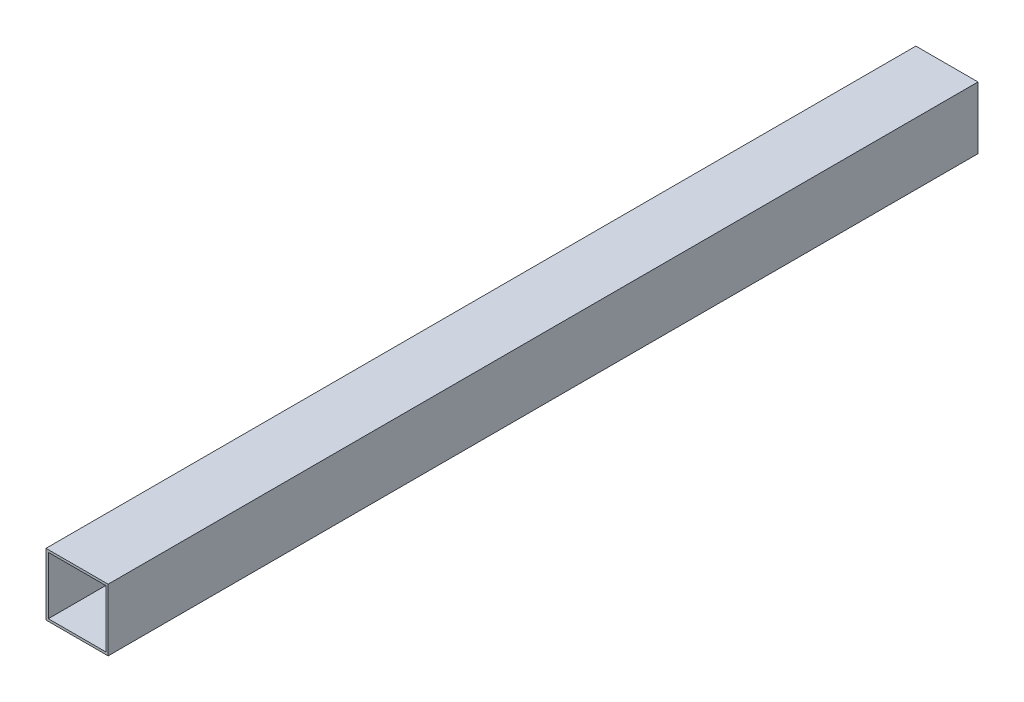
ISO-10303-21;
HEADER;
FILE_DESCRIPTION(('STEP AP214'),'2;1');
FILE_NAME('part.step','',(''),(''),'','','');
FILE_SCHEMA(('AUTOMOTIVE_DESIGN { 1 0 10303 214 1 1 1 1 }'));
ENDSEC;
DATA;
#1=APPLICATION_CONTEXT('core data for automotive mechanical design processes');
#2=APPLICATION_PROTOCOL_DEFINITION('international standard','automotive_design',2000,#1);
#3=PRODUCT_CONTEXT('',#1,'mechanical');
#4=PRODUCT('Part','Part','',(#3));
#5=PRODUCT_RELATED_PRODUCT_CATEGORY('part','',(#4));
#6=PRODUCT_DEFINITION_FORMATION('','',#4);
#7=PRODUCT_DEFINITION_CONTEXT('part definition',#1,'design');
#8=PRODUCT_DEFINITION('design','',#6,#7);
#9=PRODUCT_DEFINITION_SHAPE('','',#8);
#10=(LENGTH_UNIT() NAMED_UNIT(*) SI_UNIT(.MILLI.,.METRE.));
#11=(NAMED_UNIT(*) PLANE_ANGLE_UNIT() SI_UNIT($,.RADIAN.));
#12=(NAMED_UNIT(*) SI_UNIT($,.STERADIAN.) SOLID_ANGLE_UNIT());
#13=UNCERTAINTY_MEASURE_WITH_UNIT(LENGTH_MEASURE(1.E-05),#10,'distance_accuracy_value','');
#14=(GEOMETRIC_REPRESENTATION_CONTEXT(3) GLOBAL_UNCERTAINTY_ASSIGNED_CONTEXT((#13)) GLOBAL_UNIT_ASSIGNED_CONTEXT((#10,
#11,#12)) REPRESENTATION_CONTEXT('',''));
#15=CARTESIAN_POINT('',(0.,0.,0.));
#16=DIRECTION('',(0.,0.,1.));
#17=DIRECTION('',(1.,0.,0.));
#18=AXIS2_PLACEMENT_3D('',#15,#16,#17);
#19=CARTESIAN_POINT('',(0.,0.,560.));
#20=DIRECTION('',(0.,0.,-1.));
#21=DIRECTION('',(-1.,0.,0.));
#22=AXIS2_PLACEMENT_3D('',#19,#20,#21);
#23=PLANE('',#22);
#24=DIRECTION('',(0.,1.,0.));
#25=VECTOR('',#24,1.);
#26=CARTESIAN_POINT('',(20.,-20.,560.));
#27=LINE('',#26,#25);
#28=CARTESIAN_POINT('',(20.,-20.,560.));
#29=VERTEX_POINT('',#28);
#30=CARTESIAN_POINT('',(20.,20.,560.));
#31=VERTEX_POINT('',#30);
#32=EDGE_CURVE('E134',#29,#31,#27,.T.);
#33=ORIENTED_EDGE('',*,*,#32,.T.);
#34=DIRECTION('',(-1.,0.,0.));
#35=VECTOR('',#34,1.);
#36=CARTESIAN_POINT('',(-20.,20.,560.));
#37=LINE('',#36,#35);
#38=CARTESIAN_POINT('',(-20.,20.,560.));
#39=VERTEX_POINT('',#38);
#40=EDGE_CURVE('E137',#31,#39,#37,.T.);
#41=ORIENTED_EDGE('',*,*,#40,.T.);
#42=DIRECTION('',(0.,-1.,0.));
#43=VECTOR('',#42,1.);
#44=CARTESIAN_POINT('',(-20.,-20.,560.));
#45=LINE('',#44,#43);
#46=CARTESIAN_POINT('',(-20.,-20.,560.));
#47=VERTEX_POINT('',#46);
#48=EDGE_CURVE('E140',#39,#47,#45,.T.);
#49=ORIENTED_EDGE('',*,*,#48,.T.);
#50=DIRECTION('',(1.,0.,0.));
#51=VECTOR('',#50,1.);
#52=CARTESIAN_POINT('',(-20.,-20.,560.));
#53=LINE('',#52,#51);
#54=EDGE_CURVE('E142',#47,#29,#53,.T.);
#55=ORIENTED_EDGE('',*,*,#54,.T.);
#56=EDGE_LOOP('',(#33,#41,#49,#55));
#57=FACE_BOUND('',#56,.T.);
#58=DIRECTION('',(0.,1.,0.));
#59=VECTOR('',#58,1.);
#60=CARTESIAN_POINT('',(18.5,-18.5,560.));
#61=LINE('',#60,#59);
#62=CARTESIAN_POINT('',(18.5,-18.5,560.));
#63=VERTEX_POINT('',#62);
#64=CARTESIAN_POINT('',(18.5,18.5,560.));
#65=VERTEX_POINT('',#64);
#66=EDGE_CURVE('E98',#63,#65,#61,.T.);
#67=ORIENTED_EDGE('',*,*,#66,.F.);
#68=DIRECTION('',(1.,0.,0.));
#69=VECTOR('',#68,1.);
#70=CARTESIAN_POINT('',(-18.5,-18.5,560.));
#71=LINE('',#70,#69);
#72=CARTESIAN_POINT('',(-18.5,-18.5,560.));
#73=VERTEX_POINT('',#72);
#74=EDGE_CURVE('E120',#73,#63,#71,.T.);
#75=ORIENTED_EDGE('',*,*,#74,.F.);
#76=DIRECTION('',(0.,-1.,0.));
#77=VECTOR('',#76,1.);
#78=CARTESIAN_POINT('',(-18.5,-18.5,560.));
#79=LINE('',#78,#77);
#80=CARTESIAN_POINT('',(-18.5,18.5,560.));
#81=VERTEX_POINT('',#80);
#82=EDGE_CURVE('E118',#81,#73,#79,.T.);
#83=ORIENTED_EDGE('',*,*,#82,.F.);
#84=DIRECTION('',(-1.,0.,0.));
#85=VECTOR('',#84,1.);
#86=CARTESIAN_POINT('',(-18.5,18.5,560.));
#87=LINE('',#86,#85);
#88=EDGE_CURVE('E106',#65,#81,#87,.T.);
#89=ORIENTED_EDGE('',*,*,#88,.F.);
#90=EDGE_LOOP('',(#67,#75,#83,#89));
#91=FACE_BOUND('',#90,.T.);
#92=ADVANCED_FACE('F33',(#57,#91),#23,.F.);
#93=CARTESIAN_POINT('',(0.,0.,0.));
#94=DIRECTION('',(0.,0.,-1.));
#95=DIRECTION('',(-1.,0.,0.));
#96=AXIS2_PLACEMENT_3D('',#93,#94,#95);
#97=PLANE('',#96);
#98=DIRECTION('',(0.,1.,0.));
#99=VECTOR('',#98,1.);
#100=CARTESIAN_POINT('',(20.,-20.,0.));
#101=LINE('',#100,#99);
#102=CARTESIAN_POINT('',(20.,-20.,0.));
#103=VERTEX_POINT('',#102);
#104=CARTESIAN_POINT('',(20.,20.,0.));
#105=VERTEX_POINT('',#104);
#106=EDGE_CURVE('E114',#103,#105,#101,.T.);
#107=ORIENTED_EDGE('',*,*,#106,.F.);
#108=DIRECTION('',(1.,0.,0.));
#109=VECTOR('',#108,1.);
#110=CARTESIAN_POINT('',(-20.,-20.,0.));
#111=LINE('',#110,#109);
#112=CARTESIAN_POINT('',(-20.,-20.,0.));
#113=VERTEX_POINT('',#112);
#114=EDGE_CURVE('E138',#113,#103,#111,.T.);
#115=ORIENTED_EDGE('',*,*,#114,.F.);
#116=DIRECTION('',(0.,-1.,0.));
#117=VECTOR('',#116,1.);
#118=CARTESIAN_POINT('',(-20.,-20.,0.));
#119=LINE('',#118,#117);
#120=CARTESIAN_POINT('',(-20.,20.,0.));
#121=VERTEX_POINT('',#120);
#122=EDGE_CURVE('E149',#121,#113,#119,.T.);
#123=ORIENTED_EDGE('',*,*,#122,.F.);
#124=DIRECTION('',(-1.,0.,0.));
#125=VECTOR('',#124,1.);
#126=CARTESIAN_POINT('',(-20.,20.,0.));
#127=LINE('',#126,#125);
#128=EDGE_CURVE('E147',#105,#121,#127,.T.);
#129=ORIENTED_EDGE('',*,*,#128,.F.);
#130=EDGE_LOOP('',(#107,#115,#123,#129));
#131=FACE_BOUND('',#130,.T.);
#132=DIRECTION('',(1.,0.,0.));
#133=VECTOR('',#132,1.);
#134=CARTESIAN_POINT('',(-18.5,-18.5,0.));
#135=LINE('',#134,#133);
#136=CARTESIAN_POINT('',(-18.5,-18.5,0.));
#137=VERTEX_POINT('',#136);
#138=CARTESIAN_POINT('',(18.5,-18.5,0.));
#139=VERTEX_POINT('',#138);
#140=EDGE_CURVE('E107',#137,#139,#135,.T.);
#141=ORIENTED_EDGE('',*,*,#140,.T.);
#142=DIRECTION('',(0.,1.,0.));
#143=VECTOR('',#142,1.);
#144=CARTESIAN_POINT('',(18.5,-18.5,0.));
#145=LINE('',#144,#143);
#146=CARTESIAN_POINT('',(18.5,18.5,0.));
#147=VERTEX_POINT('',#146);
#148=EDGE_CURVE('E56',#139,#147,#145,.T.);
#149=ORIENTED_EDGE('',*,*,#148,.T.);
#150=DIRECTION('',(-1.,0.,0.));
#151=VECTOR('',#150,1.);
#152=CARTESIAN_POINT('',(-18.5,18.5,0.));
#153=LINE('',#152,#151);
#154=CARTESIAN_POINT('',(-18.5,18.5,0.));
#155=VERTEX_POINT('',#154);
#156=EDGE_CURVE('E113',#147,#155,#153,.T.);
#157=ORIENTED_EDGE('',*,*,#156,.T.);
#158=DIRECTION('',(0.,-1.,0.));
#159=VECTOR('',#158,1.);
#160=CARTESIAN_POINT('',(-18.5,-18.5,0.));
#161=LINE('',#160,#159);
#162=EDGE_CURVE('E126',#155,#137,#161,.T.);
#163=ORIENTED_EDGE('',*,*,#162,.T.);
#164=EDGE_LOOP('',(#141,#149,#157,#163));
#165=FACE_BOUND('',#164,.T.);
#166=ADVANCED_FACE('F167',(#131,#165),#97,.T.);
#167=CARTESIAN_POINT('',(20.,-20.,560.));
#168=DIRECTION('',(-1.,0.,0.));
#169=DIRECTION('',(0.,0.,1.));
#170=AXIS2_PLACEMENT_3D('',#167,#168,#169);
#171=PLANE('',#170);
#172=ORIENTED_EDGE('',*,*,#106,.T.);
#173=DIRECTION('',(0.,0.,-1.));
#174=VECTOR('',#173,1.);
#175=CARTESIAN_POINT('',(20.,20.,560.));
#176=LINE('',#175,#174);
#177=EDGE_CURVE('E11',#31,#105,#176,.T.);
#178=ORIENTED_EDGE('',*,*,#177,.F.);
#179=ORIENTED_EDGE('',*,*,#32,.F.);
#180=DIRECTION('',(0.,0.,-1.));
#181=VECTOR('',#180,1.);
#182=CARTESIAN_POINT('',(20.,-20.,560.));
#183=LINE('',#182,#181);
#184=EDGE_CURVE('E144',#29,#103,#183,.T.);
#185=ORIENTED_EDGE('',*,*,#184,.T.);
#186=EDGE_LOOP('',(#172,#178,#179,#185));
#187=FACE_BOUND('',#186,.T.);
#188=ADVANCED_FACE('F35',(#187),#171,.F.);
#189=CARTESIAN_POINT('',(-20.,20.,560.));
#190=DIRECTION('',(0.,-1.,0.));
#191=DIRECTION('',(0.,0.,-1.));
#192=AXIS2_PLACEMENT_3D('',#189,#190,#191);
#193=PLANE('',#192);
#194=ORIENTED_EDGE('',*,*,#128,.T.);
#195=DIRECTION('',(0.,0.,-1.));
#196=VECTOR('',#195,1.);
#197=CARTESIAN_POINT('',(-20.,20.,560.));
#198=LINE('',#197,#196);
#199=EDGE_CURVE('E41',#39,#121,#198,.T.);
#200=ORIENTED_EDGE('',*,*,#199,.F.);
#201=ORIENTED_EDGE('',*,*,#40,.F.);
#202=ORIENTED_EDGE('',*,*,#177,.T.);
#203=EDGE_LOOP('',(#194,#200,#201,#202));
#204=FACE_BOUND('',#203,.T.);
#205=ADVANCED_FACE('F177',(#204),#193,.F.);
#206=CARTESIAN_POINT('',(-20.,-20.,560.));
#207=DIRECTION('',(1.,0.,0.));
#208=DIRECTION('',(0.,0.,-1.));
#209=AXIS2_PLACEMENT_3D('',#206,#207,#208);
#210=PLANE('',#209);
#211=ORIENTED_EDGE('',*,*,#122,.T.);
#212=DIRECTION('',(0.,0.,-1.));
#213=VECTOR('',#212,1.);
#214=CARTESIAN_POINT('',(-20.,-20.,560.));
#215=LINE('',#214,#213);
#216=EDGE_CURVE('E154',#47,#113,#215,.T.);
#217=ORIENTED_EDGE('',*,*,#216,.F.);
#218=ORIENTED_EDGE('',*,*,#48,.F.);
#219=ORIENTED_EDGE('',*,*,#199,.T.);
#220=EDGE_LOOP('',(#211,#217,#218,#219));
#221=FACE_BOUND('',#220,.T.);
#222=ADVANCED_FACE('F161',(#221),#210,.F.);
#223=CARTESIAN_POINT('',(-20.,-20.,560.));
#224=DIRECTION('',(0.,1.,0.));
#225=DIRECTION('',(0.,0.,1.));
#226=AXIS2_PLACEMENT_3D('',#223,#224,#225);
#227=PLANE('',#226);
#228=ORIENTED_EDGE('',*,*,#114,.T.);
#229=ORIENTED_EDGE('',*,*,#184,.F.);
#230=ORIENTED_EDGE('',*,*,#54,.F.);
#231=ORIENTED_EDGE('',*,*,#216,.T.);
#232=EDGE_LOOP('',(#228,#229,#230,#231));
#233=FACE_BOUND('',#232,.T.);
#234=ADVANCED_FACE('F171',(#233),#227,.F.);
#235=CARTESIAN_POINT('',(18.5,-18.5,560.));
#236=DIRECTION('',(-1.,0.,0.));
#237=DIRECTION('',(0.,0.,1.));
#238=AXIS2_PLACEMENT_3D('',#235,#236,#237);
#239=PLANE('',#238);
#240=ORIENTED_EDGE('',*,*,#148,.F.);
#241=DIRECTION('',(0.,0.,-1.));
#242=VECTOR('',#241,1.);
#243=CARTESIAN_POINT('',(18.5,-18.5,560.));
#244=LINE('',#243,#242);
#245=EDGE_CURVE('E102',#63,#139,#244,.T.);
#246=ORIENTED_EDGE('',*,*,#245,.F.);
#247=ORIENTED_EDGE('',*,*,#66,.T.);
#248=DIRECTION('',(0.,0.,-1.));
#249=VECTOR('',#248,1.);
#250=CARTESIAN_POINT('',(18.5,18.5,560.));
#251=LINE('',#250,#249);
#252=EDGE_CURVE('E101',#65,#147,#251,.T.);
#253=ORIENTED_EDGE('',*,*,#252,.T.);
#254=EDGE_LOOP('',(#240,#246,#247,#253));
#255=FACE_BOUND('',#254,.T.);
#256=ADVANCED_FACE('F100',(#255),#239,.T.);
#257=CARTESIAN_POINT('',(-18.5,18.5,560.));
#258=DIRECTION('',(0.,-1.,0.));
#259=DIRECTION('',(0.,0.,-1.));
#260=AXIS2_PLACEMENT_3D('',#257,#258,#259);
#261=PLANE('',#260);
#262=ORIENTED_EDGE('',*,*,#156,.F.);
#263=ORIENTED_EDGE('',*,*,#252,.F.);
#264=ORIENTED_EDGE('',*,*,#88,.T.);
#265=DIRECTION('',(0.,0.,-1.));
#266=VECTOR('',#265,1.);
#267=CARTESIAN_POINT('',(-18.5,18.5,560.));
#268=LINE('',#267,#266);
#269=EDGE_CURVE('E115',#81,#155,#268,.T.);
#270=ORIENTED_EDGE('',*,*,#269,.T.);
#271=EDGE_LOOP('',(#262,#263,#264,#270));
#272=FACE_BOUND('',#271,.T.);
#273=ADVANCED_FACE('F110',(#272),#261,.T.);
#274=CARTESIAN_POINT('',(-18.5,-18.5,560.));
#275=DIRECTION('',(1.,0.,0.));
#276=DIRECTION('',(0.,0.,-1.));
#277=AXIS2_PLACEMENT_3D('',#274,#275,#276);
#278=PLANE('',#277);
#279=ORIENTED_EDGE('',*,*,#162,.F.);
#280=ORIENTED_EDGE('',*,*,#269,.F.);
#281=ORIENTED_EDGE('',*,*,#82,.T.);
#282=DIRECTION('',(0.,0.,-1.));
#283=VECTOR('',#282,1.);
#284=CARTESIAN_POINT('',(-18.5,-18.5,560.));
#285=LINE('',#284,#283);
#286=EDGE_CURVE('E48',#73,#137,#285,.T.);
#287=ORIENTED_EDGE('',*,*,#286,.T.);
#288=EDGE_LOOP('',(#279,#280,#281,#287));
#289=FACE_BOUND('',#288,.T.);
#290=ADVANCED_FACE('F200',(#289),#278,.T.);
#291=CARTESIAN_POINT('',(-18.5,-18.5,560.));
#292=DIRECTION('',(0.,1.,0.));
#293=DIRECTION('',(0.,0.,1.));
#294=AXIS2_PLACEMENT_3D('',#291,#292,#293);
#295=PLANE('',#294);
#296=ORIENTED_EDGE('',*,*,#140,.F.);
#297=ORIENTED_EDGE('',*,*,#286,.F.);
#298=ORIENTED_EDGE('',*,*,#74,.T.);
#299=ORIENTED_EDGE('',*,*,#245,.T.);
#300=EDGE_LOOP('',(#296,#297,#298,#299));
#301=FACE_BOUND('',#300,.T.);
#302=ADVANCED_FACE('F204',(#301),#295,.T.);
#303=CLOSED_SHELL('',(#92,#166,#188,#205,#222,#234,#256,#273,#290,#302));
#304=MANIFOLD_SOLID_BREP('B2',#303);
#305=ADVANCED_BREP_SHAPE_REPRESENTATION('',(#18,#304),#14);
#306=SHAPE_DEFINITION_REPRESENTATION(#9,#305);
ENDSEC;
END-ISO-10303-21;
